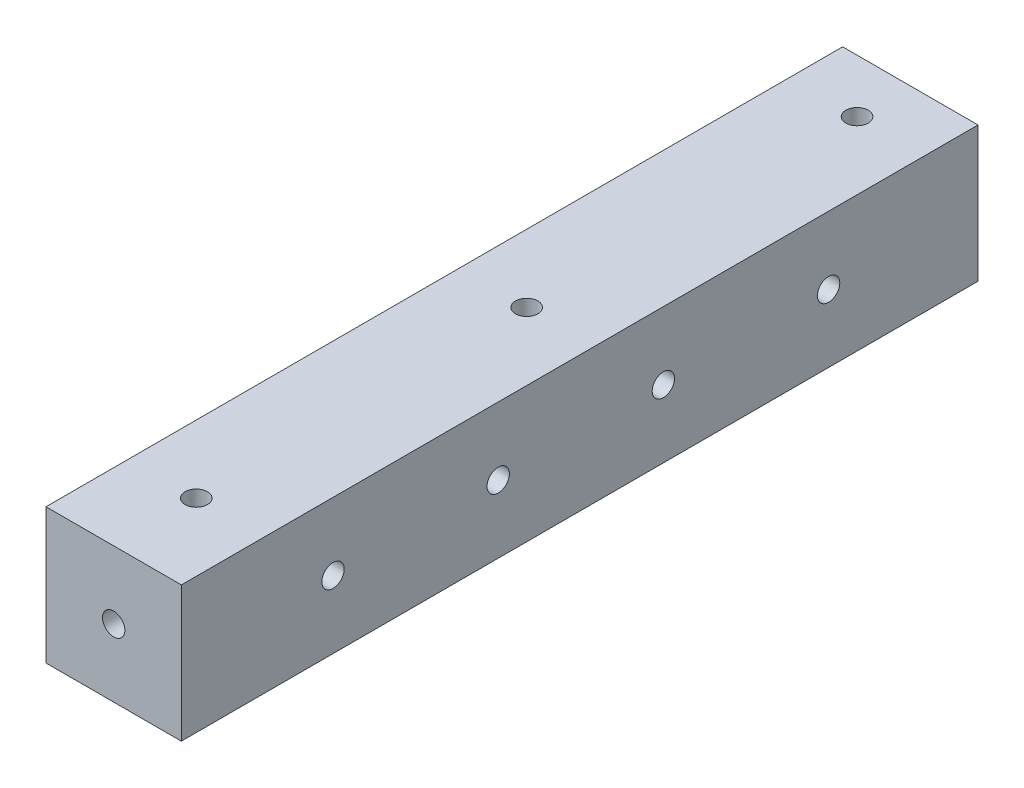
ISO-10303-21;
HEADER;
FILE_DESCRIPTION(('STEP AP214'),'2;1');
FILE_NAME('part.step','',(''),(''),'','','');
FILE_SCHEMA(('AUTOMOTIVE_DESIGN { 1 0 10303 214 1 1 1 1 }'));
ENDSEC;
DATA;
#1=APPLICATION_CONTEXT('core data for automotive mechanical design processes');
#2=APPLICATION_PROTOCOL_DEFINITION('international standard','automotive_design',2000,#1);
#3=PRODUCT_CONTEXT('',#1,'mechanical');
#4=PRODUCT('Part','Part','',(#3));
#5=PRODUCT_RELATED_PRODUCT_CATEGORY('part','',(#4));
#6=PRODUCT_DEFINITION_FORMATION('','',#4);
#7=PRODUCT_DEFINITION_CONTEXT('part definition',#1,'design');
#8=PRODUCT_DEFINITION('design','',#6,#7);
#9=PRODUCT_DEFINITION_SHAPE('','',#8);
#10=(LENGTH_UNIT() NAMED_UNIT(*) SI_UNIT(.MILLI.,.METRE.));
#11=(NAMED_UNIT(*) PLANE_ANGLE_UNIT() SI_UNIT($,.RADIAN.));
#12=(NAMED_UNIT(*) SI_UNIT($,.STERADIAN.) SOLID_ANGLE_UNIT());
#13=UNCERTAINTY_MEASURE_WITH_UNIT(LENGTH_MEASURE(1.E-05),#10,'distance_accuracy_value','');
#14=(GEOMETRIC_REPRESENTATION_CONTEXT(3) GLOBAL_UNCERTAINTY_ASSIGNED_CONTEXT((#13)) GLOBAL_UNIT_ASSIGNED_CONTEXT((#10,
#11,#12)) REPRESENTATION_CONTEXT('',''));
#15=CARTESIAN_POINT('',(0.,0.,0.));
#16=DIRECTION('',(0.,0.,1.));
#17=DIRECTION('',(1.,0.,0.));
#18=AXIS2_PLACEMENT_3D('',#15,#16,#17);
#19=CARTESIAN_POINT('',(12.7,-12.7,77.5));
#20=DIRECTION('',(-1.,0.,0.));
#21=DIRECTION('',(0.,0.,1.));
#22=AXIS2_PLACEMENT_3D('',#19,#20,#21);
#23=PLANE('',#22);
#24=CARTESIAN_POINT('',(12.7,0.,49.04));
#25=DIRECTION('',(1.,0.,0.));
#26=DIRECTION('',(0.,0.,-1.));
#27=AXIS2_PLACEMENT_3D('',#24,#25,#26);
#28=CIRCLE('',#27,2.1);
#29=CARTESIAN_POINT('',(12.7,0.,46.94));
#30=VERTEX_POINT('',#29);
#31=EDGE_CURVE('E155',#30,#30,#28,.T.);
#32=ORIENTED_EDGE('',*,*,#31,.F.);
#33=EDGE_LOOP('',(#32));
#34=FACE_BOUND('',#33,.T.);
#35=CARTESIAN_POINT('',(12.7,0.,18.04));
#36=DIRECTION('',(1.,0.,0.));
#37=DIRECTION('',(0.,0.,-1.));
#38=AXIS2_PLACEMENT_3D('',#35,#36,#37);
#39=CIRCLE('',#38,2.1);
#40=CARTESIAN_POINT('',(12.7,0.,15.94));
#41=VERTEX_POINT('',#40);
#42=EDGE_CURVE('E149',#41,#41,#39,.T.);
#43=ORIENTED_EDGE('',*,*,#42,.F.);
#44=EDGE_LOOP('',(#43));
#45=FACE_BOUND('',#44,.T.);
#46=CARTESIAN_POINT('',(12.7,0.,-12.96));
#47=DIRECTION('',(1.,0.,0.));
#48=DIRECTION('',(0.,0.,-1.));
#49=AXIS2_PLACEMENT_3D('',#46,#47,#48);
#50=CIRCLE('',#49,2.1);
#51=CARTESIAN_POINT('',(12.7,0.,-15.06));
#52=VERTEX_POINT('',#51);
#53=EDGE_CURVE('E143',#52,#52,#50,.T.);
#54=ORIENTED_EDGE('',*,*,#53,.F.);
#55=EDGE_LOOP('',(#54));
#56=FACE_BOUND('',#55,.T.);
#57=CARTESIAN_POINT('',(12.7,0.,-43.96));
#58=DIRECTION('',(1.,0.,0.));
#59=DIRECTION('',(0.,0.,-1.));
#60=AXIS2_PLACEMENT_3D('',#57,#58,#59);
#61=CIRCLE('',#60,2.1);
#62=CARTESIAN_POINT('',(12.7,0.,-46.06));
#63=VERTEX_POINT('',#62);
#64=EDGE_CURVE('E137',#63,#63,#61,.T.);
#65=ORIENTED_EDGE('',*,*,#64,.F.);
#66=EDGE_LOOP('',(#65));
#67=FACE_BOUND('',#66,.T.);
#68=DIRECTION('',(0.,0.,-1.));
#69=VECTOR('',#68,1.);
#70=CARTESIAN_POINT('',(12.7,-12.7,77.5));
#71=LINE('',#70,#69);
#72=CARTESIAN_POINT('',(12.7,-12.7,77.5));
#73=VERTEX_POINT('',#72);
#74=CARTESIAN_POINT('',(12.7,-12.7,-72.));
#75=VERTEX_POINT('',#74);
#76=EDGE_CURVE('E97',#73,#75,#71,.T.);
#77=ORIENTED_EDGE('',*,*,#76,.T.);
#78=DIRECTION('',(0.,1.,0.));
#79=VECTOR('',#78,1.);
#80=CARTESIAN_POINT('',(12.7,-12.7,-72.));
#81=LINE('',#80,#79);
#82=CARTESIAN_POINT('',(12.7,12.7,-72.));
#83=VERTEX_POINT('',#82);
#84=EDGE_CURVE('E51',#75,#83,#81,.T.);
#85=ORIENTED_EDGE('',*,*,#84,.T.);
#86=DIRECTION('',(0.,0.,-1.));
#87=VECTOR('',#86,1.);
#88=CARTESIAN_POINT('',(12.7,12.7,77.5));
#89=LINE('',#88,#87);
#90=CARTESIAN_POINT('',(12.7,12.7,77.5));
#91=VERTEX_POINT('',#90);
#92=EDGE_CURVE('E11',#91,#83,#89,.T.);
#93=ORIENTED_EDGE('',*,*,#92,.F.);
#94=DIRECTION('',(0.,1.,0.));
#95=VECTOR('',#94,1.);
#96=CARTESIAN_POINT('',(12.7,-12.7,77.5));
#97=LINE('',#96,#95);
#98=EDGE_CURVE('E106',#73,#91,#97,.T.);
#99=ORIENTED_EDGE('',*,*,#98,.F.);
#100=EDGE_LOOP('',(#77,#85,#93,#99));
#101=FACE_BOUND('',#100,.T.);
#102=ADVANCED_FACE('F37',(#34,#45,#56,#67,#101),#23,.F.);
#103=CARTESIAN_POINT('',(-12.7,12.7,77.5));
#104=DIRECTION('',(0.,-1.,0.));
#105=DIRECTION('',(0.,0.,-1.));
#106=AXIS2_PLACEMENT_3D('',#103,#104,#105);
#107=PLANE('',#106);
#108=CARTESIAN_POINT('',(0.,12.7,62.));
#109=DIRECTION('',(0.,-1.,0.));
#110=DIRECTION('',(0.,0.,-1.));
#111=AXIS2_PLACEMENT_3D('',#108,#109,#110);
#112=CIRCLE('',#111,2.09999999999999);
#113=CARTESIAN_POINT('',(0.,12.7,59.9));
#114=VERTEX_POINT('',#113);
#115=EDGE_CURVE('E120',#114,#114,#112,.T.);
#116=ORIENTED_EDGE('',*,*,#115,.T.);
#117=EDGE_LOOP('',(#116));
#118=FACE_BOUND('',#117,.T.);
#119=CARTESIAN_POINT('',(0.,12.7,0.));
#120=DIRECTION('',(0.,-1.,0.));
#121=DIRECTION('',(0.,0.,-1.));
#122=AXIS2_PLACEMENT_3D('',#119,#120,#121);
#123=CIRCLE('',#122,2.09999999999999);
#124=CARTESIAN_POINT('',(0.,12.7,-2.09999999999999));
#125=VERTEX_POINT('',#124);
#126=EDGE_CURVE('E114',#125,#125,#123,.T.);
#127=ORIENTED_EDGE('',*,*,#126,.T.);
#128=EDGE_LOOP('',(#127));
#129=FACE_BOUND('',#128,.T.);
#130=CARTESIAN_POINT('',(0.,12.7,-62.));
#131=DIRECTION('',(0.,-1.,0.));
#132=DIRECTION('',(0.,0.,-1.));
#133=AXIS2_PLACEMENT_3D('',#130,#131,#132);
#134=CIRCLE('',#133,2.09999999999999);
#135=CARTESIAN_POINT('',(0.,12.7,-64.1));
#136=VERTEX_POINT('',#135);
#137=EDGE_CURVE('E108',#136,#136,#134,.T.);
#138=ORIENTED_EDGE('',*,*,#137,.T.);
#139=EDGE_LOOP('',(#138));
#140=FACE_BOUND('',#139,.T.);
#141=ORIENTED_EDGE('',*,*,#92,.T.);
#142=DIRECTION('',(1.,0.,0.));
#143=VECTOR('',#142,1.);
#144=CARTESIAN_POINT('',(12.7,12.7,-72.));
#145=LINE('',#144,#143);
#146=CARTESIAN_POINT('',(-12.7,12.7,-72.));
#147=VERTEX_POINT('',#146);
#148=EDGE_CURVE('E86',#147,#83,#145,.T.);
#149=ORIENTED_EDGE('',*,*,#148,.F.);
#150=DIRECTION('',(0.,0.,-1.));
#151=VECTOR('',#150,1.);
#152=CARTESIAN_POINT('',(-12.7,12.7,77.5));
#153=LINE('',#152,#151);
#154=CARTESIAN_POINT('',(-12.7,12.7,77.5));
#155=VERTEX_POINT('',#154);
#156=EDGE_CURVE('E44',#155,#147,#153,.T.);
#157=ORIENTED_EDGE('',*,*,#156,.F.);
#158=DIRECTION('',(-1.,0.,0.));
#159=VECTOR('',#158,1.);
#160=CARTESIAN_POINT('',(-12.7,12.7,77.5));
#161=LINE('',#160,#159);
#162=EDGE_CURVE('E104',#91,#155,#161,.T.);
#163=ORIENTED_EDGE('',*,*,#162,.F.);
#164=EDGE_LOOP('',(#141,#149,#157,#163));
#165=FACE_BOUND('',#164,.T.);
#166=ADVANCED_FACE('F163',(#118,#129,#140,#165),#107,.F.);
#167=CARTESIAN_POINT('',(-12.7,-12.7,77.5));
#168=DIRECTION('',(1.,0.,0.));
#169=DIRECTION('',(0.,0.,-1.));
#170=AXIS2_PLACEMENT_3D('',#167,#168,#169);
#171=PLANE('',#170);
#172=CARTESIAN_POINT('',(-12.7,0.,49.04));
#173=DIRECTION('',(1.,0.,0.));
#174=DIRECTION('',(0.,0.,-1.));
#175=AXIS2_PLACEMENT_3D('',#172,#173,#174);
#176=CIRCLE('',#175,2.09999999999999);
#177=CARTESIAN_POINT('',(-12.7,0.,46.94));
#178=VERTEX_POINT('',#177);
#179=EDGE_CURVE('E152',#178,#178,#176,.T.);
#180=ORIENTED_EDGE('',*,*,#179,.T.);
#181=EDGE_LOOP('',(#180));
#182=FACE_BOUND('',#181,.T.);
#183=CARTESIAN_POINT('',(-12.7,0.,18.04));
#184=DIRECTION('',(1.,0.,0.));
#185=DIRECTION('',(0.,0.,-1.));
#186=AXIS2_PLACEMENT_3D('',#183,#184,#185);
#187=CIRCLE('',#186,2.09999999999999);
#188=CARTESIAN_POINT('',(-12.7,0.,15.94));
#189=VERTEX_POINT('',#188);
#190=EDGE_CURVE('E146',#189,#189,#187,.T.);
#191=ORIENTED_EDGE('',*,*,#190,.T.);
#192=EDGE_LOOP('',(#191));
#193=FACE_BOUND('',#192,.T.);
#194=CARTESIAN_POINT('',(-12.7,0.,-12.96));
#195=DIRECTION('',(1.,0.,0.));
#196=DIRECTION('',(0.,0.,-1.));
#197=AXIS2_PLACEMENT_3D('',#194,#195,#196);
#198=CIRCLE('',#197,2.09999999999999);
#199=CARTESIAN_POINT('',(-12.7,0.,-15.06));
#200=VERTEX_POINT('',#199);
#201=EDGE_CURVE('E140',#200,#200,#198,.T.);
#202=ORIENTED_EDGE('',*,*,#201,.T.);
#203=EDGE_LOOP('',(#202));
#204=FACE_BOUND('',#203,.T.);
#205=CARTESIAN_POINT('',(-12.7,0.,-43.96));
#206=DIRECTION('',(1.,0.,0.));
#207=DIRECTION('',(0.,0.,-1.));
#208=AXIS2_PLACEMENT_3D('',#205,#206,#207);
#209=CIRCLE('',#208,2.09999999999999);
#210=CARTESIAN_POINT('',(-12.7,0.,-46.06));
#211=VERTEX_POINT('',#210);
#212=EDGE_CURVE('E133',#211,#211,#209,.T.);
#213=ORIENTED_EDGE('',*,*,#212,.T.);
#214=EDGE_LOOP('',(#213));
#215=FACE_BOUND('',#214,.T.);
#216=ORIENTED_EDGE('',*,*,#156,.T.);
#217=DIRECTION('',(0.,1.,0.));
#218=VECTOR('',#217,1.);
#219=CARTESIAN_POINT('',(-12.7,-12.7,-72.));
#220=LINE('',#219,#218);
#221=CARTESIAN_POINT('',(-12.7,-12.7,-72.));
#222=VERTEX_POINT('',#221);
#223=EDGE_CURVE('E81',#222,#147,#220,.T.);
#224=ORIENTED_EDGE('',*,*,#223,.F.);
#225=DIRECTION('',(0.,0.,-1.));
#226=VECTOR('',#225,1.);
#227=CARTESIAN_POINT('',(-12.7,-12.7,77.5));
#228=LINE('',#227,#226);
#229=CARTESIAN_POINT('',(-12.7,-12.7,77.5));
#230=VERTEX_POINT('',#229);
#231=EDGE_CURVE('E93',#230,#222,#228,.T.);
#232=ORIENTED_EDGE('',*,*,#231,.F.);
#233=DIRECTION('',(0.,-1.,0.));
#234=VECTOR('',#233,1.);
#235=CARTESIAN_POINT('',(-12.7,-12.7,77.5));
#236=LINE('',#235,#234);
#237=EDGE_CURVE('E102',#155,#230,#236,.T.);
#238=ORIENTED_EDGE('',*,*,#237,.F.);
#239=EDGE_LOOP('',(#216,#224,#232,#238));
#240=FACE_BOUND('',#239,.T.);
#241=ADVANCED_FACE('F91',(#182,#193,#204,#215,#240),#171,.F.);
#242=CARTESIAN_POINT('',(-12.7,-12.7,77.5));
#243=DIRECTION('',(0.,1.,0.));
#244=DIRECTION('',(0.,0.,1.));
#245=AXIS2_PLACEMENT_3D('',#242,#243,#244);
#246=PLANE('',#245);
#247=CARTESIAN_POINT('',(0.,-12.7,62.));
#248=DIRECTION('',(0.,-1.,0.));
#249=DIRECTION('',(0.,0.,-1.));
#250=AXIS2_PLACEMENT_3D('',#247,#248,#249);
#251=CIRCLE('',#250,2.1);
#252=CARTESIAN_POINT('',(0.,-12.7,59.9));
#253=VERTEX_POINT('',#252);
#254=EDGE_CURVE('E123',#253,#253,#251,.T.);
#255=ORIENTED_EDGE('',*,*,#254,.F.);
#256=EDGE_LOOP('',(#255));
#257=FACE_BOUND('',#256,.T.);
#258=CARTESIAN_POINT('',(0.,-12.7,0.));
#259=DIRECTION('',(0.,-1.,0.));
#260=DIRECTION('',(0.,0.,-1.));
#261=AXIS2_PLACEMENT_3D('',#258,#259,#260);
#262=CIRCLE('',#261,2.1);
#263=CARTESIAN_POINT('',(0.,-12.7,-2.1));
#264=VERTEX_POINT('',#263);
#265=EDGE_CURVE('E117',#264,#264,#262,.T.);
#266=ORIENTED_EDGE('',*,*,#265,.F.);
#267=EDGE_LOOP('',(#266));
#268=FACE_BOUND('',#267,.T.);
#269=CARTESIAN_POINT('',(0.,-12.7,-62.));
#270=DIRECTION('',(0.,-1.,0.));
#271=DIRECTION('',(0.,0.,-1.));
#272=AXIS2_PLACEMENT_3D('',#269,#270,#271);
#273=CIRCLE('',#272,2.1);
#274=CARTESIAN_POINT('',(0.,-12.7,-64.1));
#275=VERTEX_POINT('',#274);
#276=EDGE_CURVE('E111',#275,#275,#273,.T.);
#277=ORIENTED_EDGE('',*,*,#276,.F.);
#278=EDGE_LOOP('',(#277));
#279=FACE_BOUND('',#278,.T.);
#280=ORIENTED_EDGE('',*,*,#231,.T.);
#281=DIRECTION('',(1.,0.,0.));
#282=VECTOR('',#281,1.);
#283=CARTESIAN_POINT('',(12.7,-12.7,-72.));
#284=LINE('',#283,#282);
#285=EDGE_CURVE('E78',#222,#75,#284,.T.);
#286=ORIENTED_EDGE('',*,*,#285,.T.);
#287=ORIENTED_EDGE('',*,*,#76,.F.);
#288=DIRECTION('',(1.,0.,0.));
#289=VECTOR('',#288,1.);
#290=CARTESIAN_POINT('',(-12.7,-12.7,77.5));
#291=LINE('',#290,#289);
#292=EDGE_CURVE('E59',#230,#73,#291,.T.);
#293=ORIENTED_EDGE('',*,*,#292,.F.);
#294=EDGE_LOOP('',(#280,#286,#287,#293));
#295=FACE_BOUND('',#294,.T.);
#296=ADVANCED_FACE('F96',(#257,#268,#279,#295),#246,.F.);
#297=CARTESIAN_POINT('',(0.,0.,77.5));
#298=DIRECTION('',(0.,0.,-1.));
#299=DIRECTION('',(-1.,0.,0.));
#300=AXIS2_PLACEMENT_3D('',#297,#298,#299);
#301=PLANE('',#300);
#302=CARTESIAN_POINT('',(0.,0.,77.5));
#303=DIRECTION('',(0.,0.,1.));
#304=DIRECTION('',(1.,0.,0.));
#305=AXIS2_PLACEMENT_3D('',#302,#303,#304);
#306=CIRCLE('',#305,2.1);
#307=CARTESIAN_POINT('',(2.1,0.,77.5));
#308=VERTEX_POINT('',#307);
#309=EDGE_CURVE('E129',#308,#308,#306,.T.);
#310=ORIENTED_EDGE('',*,*,#309,.F.);
#311=EDGE_LOOP('',(#310));
#312=FACE_BOUND('',#311,.T.);
#313=ORIENTED_EDGE('',*,*,#98,.T.);
#314=ORIENTED_EDGE('',*,*,#162,.T.);
#315=ORIENTED_EDGE('',*,*,#237,.T.);
#316=ORIENTED_EDGE('',*,*,#292,.T.);
#317=EDGE_LOOP('',(#313,#314,#315,#316));
#318=FACE_BOUND('',#317,.T.);
#319=ADVANCED_FACE('F172',(#312,#318),#301,.F.);
#320=CARTESIAN_POINT('',(0.,-12.7,-62.));
#321=DIRECTION('',(0.,-1.,0.));
#322=DIRECTION('',(0.,0.,-1.));
#323=AXIS2_PLACEMENT_3D('',#320,#321,#322);
#324=CYLINDRICAL_SURFACE('',#323,2.1);
#325=ORIENTED_EDGE('',*,*,#137,.F.);
#326=EDGE_LOOP('',(#325));
#327=FACE_BOUND('',#326,.T.);
#328=ORIENTED_EDGE('',*,*,#276,.T.);
#329=EDGE_LOOP('',(#328));
#330=FACE_BOUND('',#329,.T.);
#331=ADVANCED_FACE('F188',(#327,#330),#324,.F.);
#332=CARTESIAN_POINT('',(0.,-12.7,0.));
#333=DIRECTION('',(0.,-1.,0.));
#334=DIRECTION('',(0.,0.,-1.));
#335=AXIS2_PLACEMENT_3D('',#332,#333,#334);
#336=CYLINDRICAL_SURFACE('',#335,2.1);
#337=ORIENTED_EDGE('',*,*,#126,.F.);
#338=EDGE_LOOP('',(#337));
#339=FACE_BOUND('',#338,.T.);
#340=ORIENTED_EDGE('',*,*,#265,.T.);
#341=EDGE_LOOP('',(#340));
#342=FACE_BOUND('',#341,.T.);
#343=ADVANCED_FACE('F192',(#339,#342),#336,.F.);
#344=CARTESIAN_POINT('',(0.,-12.7,62.));
#345=DIRECTION('',(0.,-1.,0.));
#346=DIRECTION('',(0.,0.,-1.));
#347=AXIS2_PLACEMENT_3D('',#344,#345,#346);
#348=CYLINDRICAL_SURFACE('',#347,2.1);
#349=ORIENTED_EDGE('',*,*,#115,.F.);
#350=EDGE_LOOP('',(#349));
#351=FACE_BOUND('',#350,.T.);
#352=ORIENTED_EDGE('',*,*,#254,.T.);
#353=EDGE_LOOP('',(#352));
#354=FACE_BOUND('',#353,.T.);
#355=ADVANCED_FACE('F196',(#351,#354),#348,.F.);
#356=CARTESIAN_POINT('',(0.,0.,67.5));
#357=DIRECTION('',(0.,0.,1.));
#358=DIRECTION('',(1.,0.,0.));
#359=AXIS2_PLACEMENT_3D('',#356,#357,#358);
#360=CONICAL_SURFACE('',#359,2.1,1.02974425867665);
#361=CARTESIAN_POINT('',(0.,0.,66.2381927000421));
#362=VERTEX_POINT('',#361);
#363=VERTEX_LOOP('',#362);
#364=FACE_BOUND('',#363,.T.);
#365=CARTESIAN_POINT('',(0.,0.,67.5));
#366=DIRECTION('',(0.,0.,1.));
#367=DIRECTION('',(1.,0.,0.));
#368=AXIS2_PLACEMENT_3D('',#365,#366,#367);
#369=CIRCLE('',#368,2.1);
#370=CARTESIAN_POINT('',(2.1,0.,67.5));
#371=VERTEX_POINT('',#370);
#372=EDGE_CURVE('E126',#371,#371,#369,.T.);
#373=ORIENTED_EDGE('',*,*,#372,.T.);
#374=EDGE_LOOP('',(#373));
#375=FACE_BOUND('',#374,.T.);
#376=ADVANCED_FACE('F200',(#364,#375),#360,.F.);
#377=CARTESIAN_POINT('',(0.,0.,77.5));
#378=DIRECTION('',(0.,0.,1.));
#379=DIRECTION('',(1.,0.,0.));
#380=AXIS2_PLACEMENT_3D('',#377,#378,#379);
#381=CYLINDRICAL_SURFACE('',#380,2.1);
#382=ORIENTED_EDGE('',*,*,#372,.F.);
#383=EDGE_LOOP('',(#382));
#384=FACE_BOUND('',#383,.T.);
#385=ORIENTED_EDGE('',*,*,#309,.T.);
#386=EDGE_LOOP('',(#385));
#387=FACE_BOUND('',#386,.T.);
#388=ADVANCED_FACE('F204',(#384,#387),#381,.F.);
#389=CARTESIAN_POINT('',(12.7,-12.7,-72.));
#390=DIRECTION('',(0.,0.,1.));
#391=DIRECTION('',(1.,0.,0.));
#392=AXIS2_PLACEMENT_3D('',#389,#390,#391);
#393=PLANE('',#392);
#394=ORIENTED_EDGE('',*,*,#148,.T.);
#395=ORIENTED_EDGE('',*,*,#84,.F.);
#396=ORIENTED_EDGE('',*,*,#285,.F.);
#397=ORIENTED_EDGE('',*,*,#223,.T.);
#398=EDGE_LOOP('',(#394,#395,#396,#397));
#399=FACE_BOUND('',#398,.T.);
#400=ADVANCED_FACE('F80',(#399),#393,.F.);
#401=CARTESIAN_POINT('',(12.7,0.,-43.96));
#402=DIRECTION('',(1.,0.,0.));
#403=DIRECTION('',(0.,0.,-1.));
#404=AXIS2_PLACEMENT_3D('',#401,#402,#403);
#405=CYLINDRICAL_SURFACE('',#404,2.1);
#406=ORIENTED_EDGE('',*,*,#212,.F.);
#407=EDGE_LOOP('',(#406));
#408=FACE_BOUND('',#407,.T.);
#409=ORIENTED_EDGE('',*,*,#64,.T.);
#410=EDGE_LOOP('',(#409));
#411=FACE_BOUND('',#410,.T.);
#412=ADVANCED_FACE('F211',(#408,#411),#405,.F.);
#413=CARTESIAN_POINT('',(12.7,0.,-12.96));
#414=DIRECTION('',(1.,0.,0.));
#415=DIRECTION('',(0.,0.,-1.));
#416=AXIS2_PLACEMENT_3D('',#413,#414,#415);
#417=CYLINDRICAL_SURFACE('',#416,2.1);
#418=ORIENTED_EDGE('',*,*,#201,.F.);
#419=EDGE_LOOP('',(#418));
#420=FACE_BOUND('',#419,.T.);
#421=ORIENTED_EDGE('',*,*,#53,.T.);
#422=EDGE_LOOP('',(#421));
#423=FACE_BOUND('',#422,.T.);
#424=ADVANCED_FACE('F214',(#420,#423),#417,.F.);
#425=CARTESIAN_POINT('',(12.7,0.,18.04));
#426=DIRECTION('',(1.,0.,0.));
#427=DIRECTION('',(0.,0.,-1.));
#428=AXIS2_PLACEMENT_3D('',#425,#426,#427);
#429=CYLINDRICAL_SURFACE('',#428,2.1);
#430=ORIENTED_EDGE('',*,*,#190,.F.);
#431=EDGE_LOOP('',(#430));
#432=FACE_BOUND('',#431,.T.);
#433=ORIENTED_EDGE('',*,*,#42,.T.);
#434=EDGE_LOOP('',(#433));
#435=FACE_BOUND('',#434,.T.);
#436=ADVANCED_FACE('F218',(#432,#435),#429,.F.);
#437=CARTESIAN_POINT('',(12.7,0.,49.04));
#438=DIRECTION('',(1.,0.,0.));
#439=DIRECTION('',(0.,0.,-1.));
#440=AXIS2_PLACEMENT_3D('',#437,#438,#439);
#441=CYLINDRICAL_SURFACE('',#440,2.1);
#442=ORIENTED_EDGE('',*,*,#179,.F.);
#443=EDGE_LOOP('',(#442));
#444=FACE_BOUND('',#443,.T.);
#445=ORIENTED_EDGE('',*,*,#31,.T.);
#446=EDGE_LOOP('',(#445));
#447=FACE_BOUND('',#446,.T.);
#448=ADVANCED_FACE('F159',(#444,#447),#441,.F.);
#449=CLOSED_SHELL('',(#102,#166,#241,#296,#319,#331,#343,#355,#376,#388,#400,#412,#424,#436,#448));
#450=MANIFOLD_SOLID_BREP('B2',#449);
#451=ADVANCED_BREP_SHAPE_REPRESENTATION('',(#18,#450),#14);
#452=SHAPE_DEFINITION_REPRESENTATION(#9,#451);
ENDSEC;
END-ISO-10303-21;
